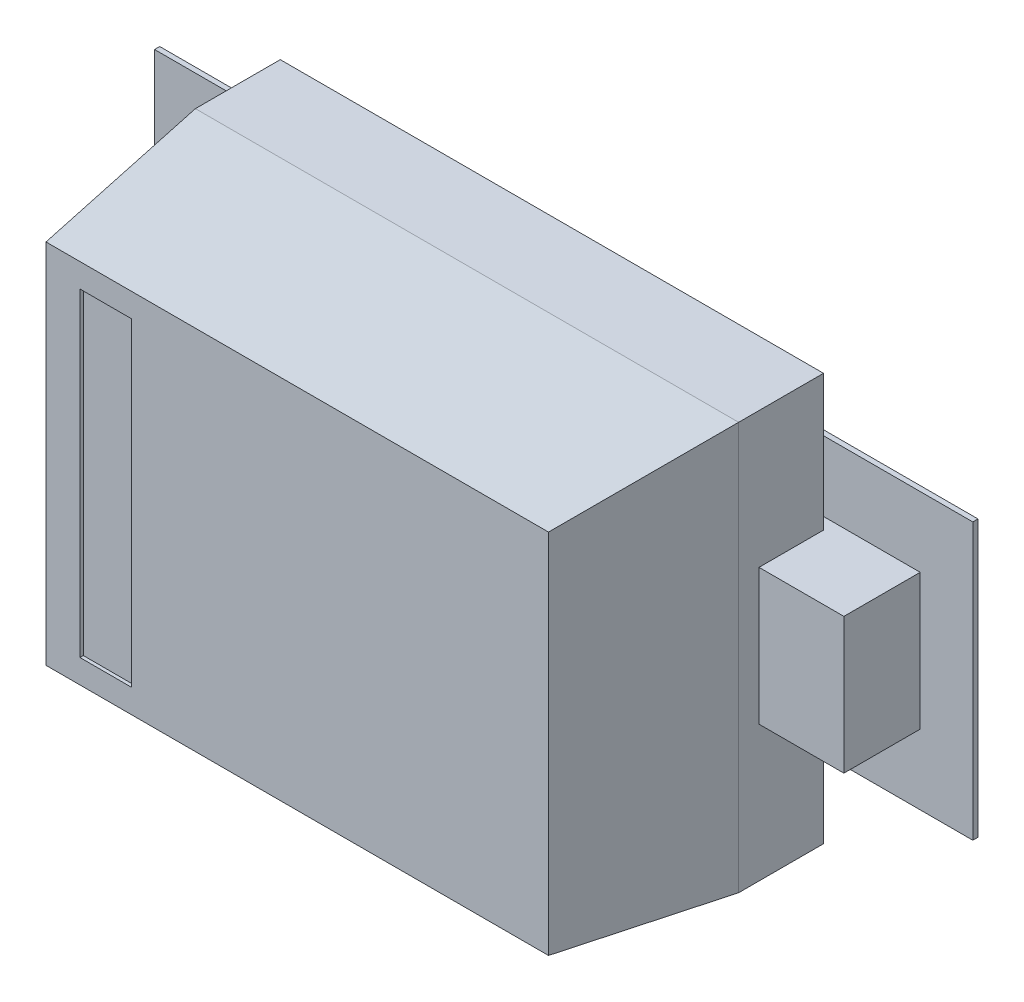
ISO-10303-21;
HEADER;
FILE_DESCRIPTION(('STEP AP214'),'2;1');
FILE_NAME('part.step','',(''),(''),'','','');
FILE_SCHEMA(('AUTOMOTIVE_DESIGN { 1 0 10303 214 1 1 1 1 }'));
ENDSEC;
DATA;
#1=APPLICATION_CONTEXT('core data for automotive mechanical design processes');
#2=APPLICATION_PROTOCOL_DEFINITION('international standard','automotive_design',2000,#1);
#3=PRODUCT_CONTEXT('',#1,'mechanical');
#4=PRODUCT('Part','Part','',(#3));
#5=PRODUCT_RELATED_PRODUCT_CATEGORY('part','',(#4));
#6=PRODUCT_DEFINITION_FORMATION('','',#4);
#7=PRODUCT_DEFINITION_CONTEXT('part definition',#1,'design');
#8=PRODUCT_DEFINITION('design','',#6,#7);
#9=PRODUCT_DEFINITION_SHAPE('','',#8);
#10=(LENGTH_UNIT() NAMED_UNIT(*) SI_UNIT(.MILLI.,.METRE.));
#11=(NAMED_UNIT(*) PLANE_ANGLE_UNIT() SI_UNIT($,.RADIAN.));
#12=(NAMED_UNIT(*) SI_UNIT($,.STERADIAN.) SOLID_ANGLE_UNIT());
#13=UNCERTAINTY_MEASURE_WITH_UNIT(LENGTH_MEASURE(1.E-05),#10,'distance_accuracy_value','');
#14=(GEOMETRIC_REPRESENTATION_CONTEXT(3) GLOBAL_UNCERTAINTY_ASSIGNED_CONTEXT((#13)) GLOBAL_UNIT_ASSIGNED_CONTEXT((#10,
#11,#12)) REPRESENTATION_CONTEXT('',''));
#15=CARTESIAN_POINT('',(0.,0.,0.));
#16=DIRECTION('',(0.,0.,1.));
#17=DIRECTION('',(1.,0.,0.));
#18=AXIS2_PLACEMENT_3D('',#15,#16,#17);
#19=CARTESIAN_POINT('',(-0.525,-0.1,0.0762));
#20=DIRECTION('',(-1.,0.,0.));
#21=DIRECTION('',(0.,0.,1.));
#22=AXIS2_PLACEMENT_3D('',#19,#20,#21);
#23=PLANE('',#22);
#24=DIRECTION('',(0.,1.,0.));
#25=VECTOR('',#24,1.);
#26=CARTESIAN_POINT('',(-0.525,-0.1,0.08382));
#27=LINE('',#26,#25);
#28=CARTESIAN_POINT('',(-0.525,-0.1,0.08382));
#29=VERTEX_POINT('',#28);
#30=CARTESIAN_POINT('',(-0.525,0.1,0.08382));
#31=VERTEX_POINT('',#30);
#32=EDGE_CURVE('E421',#29,#31,#27,.T.);
#33=ORIENTED_EDGE('',*,*,#32,.F.);
#34=DIRECTION('',(0.,0.,1.));
#35=VECTOR('',#34,1.);
#36=CARTESIAN_POINT('',(-0.525,-0.1,0.08382));
#37=LINE('',#36,#35);
#38=CARTESIAN_POINT('',(-0.525,-0.1,0.1962));
#39=VERTEX_POINT('',#38);
#40=EDGE_CURVE('E417',#29,#39,#37,.T.);
#41=ORIENTED_EDGE('',*,*,#40,.T.);
#42=DIRECTION('',(0.,1.,0.));
#43=VECTOR('',#42,1.);
#44=CARTESIAN_POINT('',(-0.525,-0.1,0.1962));
#45=LINE('',#44,#43);
#46=CARTESIAN_POINT('',(-0.525,0.1,0.1962));
#47=VERTEX_POINT('',#46);
#48=EDGE_CURVE('E11',#39,#47,#45,.T.);
#49=ORIENTED_EDGE('',*,*,#48,.T.);
#50=DIRECTION('',(0.,0.,1.));
#51=VECTOR('',#50,1.);
#52=CARTESIAN_POINT('',(-0.525,0.1,0.08382));
#53=LINE('',#52,#51);
#54=EDGE_CURVE('E457',#31,#47,#53,.T.);
#55=ORIENTED_EDGE('',*,*,#54,.F.);
#56=EDGE_LOOP('',(#33,#41,#49,#55));
#57=FACE_BOUND('',#56,.T.);
#58=ADVANCED_FACE('F16',(#57),#23,.T.);
#59=CARTESIAN_POINT('',(-0.525,-0.1,0.1962));
#60=DIRECTION('',(0.,0.,1.));
#61=DIRECTION('',(1.,0.,0.));
#62=AXIS2_PLACEMENT_3D('',#59,#60,#61);
#63=PLANE('',#62);
#64=DIRECTION('',(1.,0.,0.));
#65=VECTOR('',#64,1.);
#66=CARTESIAN_POINT('',(-0.525,-0.1,0.1962));
#67=LINE('',#66,#65);
#68=CARTESIAN_POINT('',(-0.4,-0.1,0.1962));
#69=VERTEX_POINT('',#68);
#70=EDGE_CURVE('E414',#39,#69,#67,.T.);
#71=ORIENTED_EDGE('',*,*,#70,.T.);
#72=DIRECTION('',(0.,1.,0.));
#73=VECTOR('',#72,1.);
#74=CARTESIAN_POINT('',(-0.4,-0.1,0.1962));
#75=LINE('',#74,#73);
#76=CARTESIAN_POINT('',(-0.4,0.1,0.1962));
#77=VERTEX_POINT('',#76);
#78=EDGE_CURVE('E400',#69,#77,#75,.T.);
#79=ORIENTED_EDGE('',*,*,#78,.T.);
#80=DIRECTION('',(1.,0.,0.));
#81=VECTOR('',#80,1.);
#82=CARTESIAN_POINT('',(-0.525,0.1,0.1962));
#83=LINE('',#82,#81);
#84=EDGE_CURVE('E408',#47,#77,#83,.T.);
#85=ORIENTED_EDGE('',*,*,#84,.F.);
#86=ORIENTED_EDGE('',*,*,#48,.F.);
#87=EDGE_LOOP('',(#71,#79,#85,#86));
#88=FACE_BOUND('',#87,.T.);
#89=ADVANCED_FACE('F695',(#88),#63,.T.);
#90=CARTESIAN_POINT('',(-0.325,-0.1,0.1962));
#91=DIRECTION('',(1.,0.,0.));
#92=DIRECTION('',(0.,1.,0.));
#93=AXIS2_PLACEMENT_3D('',#90,#91,#92);
#94=PLANE('',#93);
#95=DIRECTION('',(0.,1.,0.));
#96=VECTOR('',#95,1.);
#97=CARTESIAN_POINT('',(-0.325,-0.1,0.08382));
#98=LINE('',#97,#96);
#99=CARTESIAN_POINT('',(-0.325,-0.1,0.08382));
#100=VERTEX_POINT('',#99);
#101=CARTESIAN_POINT('',(-0.325,0.1,0.08382));
#102=VERTEX_POINT('',#101);
#103=EDGE_CURVE('E331',#100,#102,#98,.T.);
#104=ORIENTED_EDGE('',*,*,#103,.T.);
#105=DIRECTION('',(0.,0.,-1.));
#106=VECTOR('',#105,1.);
#107=CARTESIAN_POINT('',(-0.325,0.1,0.1012));
#108=LINE('',#107,#106);
#109=CARTESIAN_POINT('',(-0.325,0.1,0.1012));
#110=VERTEX_POINT('',#109);
#111=EDGE_CURVE('E26',#110,#102,#108,.T.);
#112=ORIENTED_EDGE('',*,*,#111,.F.);
#113=DIRECTION('',(0.,1.,0.));
#114=VECTOR('',#113,1.);
#115=CARTESIAN_POINT('',(-0.325,-0.1,0.1012));
#116=LINE('',#115,#114);
#117=CARTESIAN_POINT('',(-0.325,-0.1,0.1012));
#118=VERTEX_POINT('',#117);
#119=EDGE_CURVE('E429',#118,#110,#116,.T.);
#120=ORIENTED_EDGE('',*,*,#119,.F.);
#121=DIRECTION('',(0.,0.,-1.));
#122=VECTOR('',#121,1.);
#123=CARTESIAN_POINT('',(-0.325,-0.1,0.1012));
#124=LINE('',#123,#122);
#125=EDGE_CURVE('E312',#118,#100,#124,.T.);
#126=ORIENTED_EDGE('',*,*,#125,.T.);
#127=EDGE_LOOP('',(#104,#112,#120,#126));
#128=FACE_BOUND('',#127,.T.);
#129=ADVANCED_FACE('F699',(#128),#94,.T.);
#130=CARTESIAN_POINT('',(0.325,-0.1,0.0762));
#131=DIRECTION('',(-1.,0.,0.));
#132=DIRECTION('',(0.,0.,1.));
#133=AXIS2_PLACEMENT_3D('',#130,#131,#132);
#134=PLANE('',#133);
#135=DIRECTION('',(0.,1.,0.));
#136=VECTOR('',#135,1.);
#137=CARTESIAN_POINT('',(0.325,-0.1,0.08382));
#138=LINE('',#137,#136);
#139=CARTESIAN_POINT('',(0.325,-0.1,0.08382));
#140=VERTEX_POINT('',#139);
#141=CARTESIAN_POINT('',(0.325,0.1,0.08382));
#142=VERTEX_POINT('',#141);
#143=EDGE_CURVE('E370',#140,#142,#138,.T.);
#144=ORIENTED_EDGE('',*,*,#143,.F.);
#145=DIRECTION('',(0.,0.,1.));
#146=VECTOR('',#145,1.);
#147=CARTESIAN_POINT('',(0.325,-0.1,0.08382));
#148=LINE('',#147,#146);
#149=CARTESIAN_POINT('',(0.325,-0.1,0.1012));
#150=VERTEX_POINT('',#149);
#151=EDGE_CURVE('E313',#140,#150,#148,.T.);
#152=ORIENTED_EDGE('',*,*,#151,.T.);
#153=DIRECTION('',(0.,1.,0.));
#154=VECTOR('',#153,1.);
#155=CARTESIAN_POINT('',(0.325,-0.1,0.1012));
#156=LINE('',#155,#154);
#157=CARTESIAN_POINT('',(0.325,0.1,0.1012));
#158=VERTEX_POINT('',#157);
#159=EDGE_CURVE('E291',#150,#158,#156,.T.);
#160=ORIENTED_EDGE('',*,*,#159,.T.);
#161=DIRECTION('',(0.,0.,1.));
#162=VECTOR('',#161,1.);
#163=CARTESIAN_POINT('',(0.325,0.1,0.08382));
#164=LINE('',#163,#162);
#165=EDGE_CURVE('E286',#142,#158,#164,.T.);
#166=ORIENTED_EDGE('',*,*,#165,.F.);
#167=EDGE_LOOP('',(#144,#152,#160,#166));
#168=FACE_BOUND('',#167,.T.);
#169=ADVANCED_FACE('F731',(#168),#134,.T.);
#170=CARTESIAN_POINT('',(0.,0.1,0.));
#171=DIRECTION('',(0.,1.,0.));
#172=DIRECTION('',(1.,0.,0.));
#173=AXIS2_PLACEMENT_3D('',#170,#171,#172);
#174=PLANE('',#173);
#175=DIRECTION('',(-1.,0.,0.));
#176=VECTOR('',#175,1.);
#177=CARTESIAN_POINT('',(-0.325,0.1,0.08382));
#178=LINE('',#177,#176);
#179=EDGE_CURVE('E476',#102,#31,#178,.T.);
#180=ORIENTED_EDGE('',*,*,#179,.T.);
#181=ORIENTED_EDGE('',*,*,#54,.T.);
#182=ORIENTED_EDGE('',*,*,#84,.T.);
#183=DIRECTION('',(0.,0.,1.));
#184=VECTOR('',#183,1.);
#185=CARTESIAN_POINT('',(-0.4,0.1,0.1012));
#186=LINE('',#185,#184);
#187=CARTESIAN_POINT('',(-0.4,0.1,0.1012));
#188=VERTEX_POINT('',#187);
#189=EDGE_CURVE('E396',#188,#77,#186,.T.);
#190=ORIENTED_EDGE('',*,*,#189,.F.);
#191=DIRECTION('',(1.,0.,0.));
#192=VECTOR('',#191,1.);
#193=CARTESIAN_POINT('',(-0.4,0.1,0.1012));
#194=LINE('',#193,#192);
#195=EDGE_CURVE('E303',#188,#110,#194,.T.);
#196=ORIENTED_EDGE('',*,*,#195,.T.);
#197=ORIENTED_EDGE('',*,*,#111,.T.);
#198=EDGE_LOOP('',(#180,#181,#182,#190,#196,#197));
#199=FACE_BOUND('',#198,.T.);
#200=ADVANCED_FACE('F729',(#199),#174,.T.);
#201=CARTESIAN_POINT('',(0.,0.1,0.));
#202=DIRECTION('',(0.,1.,0.));
#203=DIRECTION('',(1.,0.,0.));
#204=AXIS2_PLACEMENT_3D('',#201,#202,#203);
#205=PLANE('',#204);
#206=DIRECTION('',(-1.,0.,0.));
#207=VECTOR('',#206,1.);
#208=CARTESIAN_POINT('',(0.525,0.1,0.08382));
#209=LINE('',#208,#207);
#210=CARTESIAN_POINT('',(0.525,0.1,0.08382));
#211=VERTEX_POINT('',#210);
#212=EDGE_CURVE('E374',#211,#142,#209,.T.);
#213=ORIENTED_EDGE('',*,*,#212,.T.);
#214=ORIENTED_EDGE('',*,*,#165,.T.);
#215=DIRECTION('',(1.,0.,0.));
#216=VECTOR('',#215,1.);
#217=CARTESIAN_POINT('',(0.325,0.1,0.1012));
#218=LINE('',#217,#216);
#219=CARTESIAN_POINT('',(0.4,0.1,0.1012));
#220=VERTEX_POINT('',#219);
#221=EDGE_CURVE('E283',#158,#220,#218,.T.);
#222=ORIENTED_EDGE('',*,*,#221,.T.);
#223=DIRECTION('',(0.,0.,-1.));
#224=VECTOR('',#223,1.);
#225=CARTESIAN_POINT('',(0.4,0.1,0.1962));
#226=LINE('',#225,#224);
#227=CARTESIAN_POINT('',(0.4,0.1,0.1962));
#228=VERTEX_POINT('',#227);
#229=EDGE_CURVE('E265',#228,#220,#226,.T.);
#230=ORIENTED_EDGE('',*,*,#229,.F.);
#231=DIRECTION('',(1.,0.,0.));
#232=VECTOR('',#231,1.);
#233=CARTESIAN_POINT('',(0.4,0.1,0.1962));
#234=LINE('',#233,#232);
#235=CARTESIAN_POINT('',(0.525,0.1,0.1962));
#236=VERTEX_POINT('',#235);
#237=EDGE_CURVE('E462',#228,#236,#234,.T.);
#238=ORIENTED_EDGE('',*,*,#237,.T.);
#239=DIRECTION('',(0.,0.,-1.));
#240=VECTOR('',#239,1.);
#241=CARTESIAN_POINT('',(0.525,0.1,0.1962));
#242=LINE('',#241,#240);
#243=EDGE_CURVE('E453',#236,#211,#242,.T.);
#244=ORIENTED_EDGE('',*,*,#243,.T.);
#245=EDGE_LOOP('',(#213,#214,#222,#230,#238,#244));
#246=FACE_BOUND('',#245,.T.);
#247=ADVANCED_FACE('F285',(#246),#205,.T.);
#248=CARTESIAN_POINT('',(0.,0.3,0.));
#249=DIRECTION('',(0.,1.,0.));
#250=DIRECTION('',(1.,0.,0.));
#251=AXIS2_PLACEMENT_3D('',#248,#249,#250);
#252=PLANE('',#251);
#253=DIRECTION('',(1.,0.,0.));
#254=VECTOR('',#253,1.);
#255=CARTESIAN_POINT('',(-0.4,0.3,0.2262));
#256=LINE('',#255,#254);
#257=CARTESIAN_POINT('',(-0.4,0.3,0.2262));
#258=VERTEX_POINT('',#257);
#259=CARTESIAN_POINT('',(0.4,0.3,0.2262));
#260=VERTEX_POINT('',#259);
#261=EDGE_CURVE('E19',#258,#260,#256,.T.);
#262=ORIENTED_EDGE('',*,*,#261,.T.);
#263=DIRECTION('',(0.,0.,-1.));
#264=VECTOR('',#263,1.);
#265=CARTESIAN_POINT('',(0.4,0.3,0.2262));
#266=LINE('',#265,#264);
#267=CARTESIAN_POINT('',(0.4,0.3,0.1012));
#268=VERTEX_POINT('',#267);
#269=EDGE_CURVE('E279',#260,#268,#266,.T.);
#270=ORIENTED_EDGE('',*,*,#269,.T.);
#271=DIRECTION('',(-1.,0.,0.));
#272=VECTOR('',#271,1.);
#273=CARTESIAN_POINT('',(0.4,0.3,0.1012));
#274=LINE('',#273,#272);
#275=CARTESIAN_POINT('',(-0.4,0.3,0.1012));
#276=VERTEX_POINT('',#275);
#277=EDGE_CURVE('E296',#268,#276,#274,.T.);
#278=ORIENTED_EDGE('',*,*,#277,.T.);
#279=DIRECTION('',(0.,0.,1.));
#280=VECTOR('',#279,1.);
#281=CARTESIAN_POINT('',(-0.4,0.3,0.1012));
#282=LINE('',#281,#280);
#283=EDGE_CURVE('E424',#276,#258,#282,.T.);
#284=ORIENTED_EDGE('',*,*,#283,.T.);
#285=EDGE_LOOP('',(#262,#270,#278,#284));
#286=FACE_BOUND('',#285,.T.);
#287=ADVANCED_FACE('F736',(#286),#252,.T.);
#288=CARTESIAN_POINT('',(0.,0.285,0.3512));
#289=DIRECTION('',(0.,0.992876838486925,0.119145220618403));
#290=DIRECTION('',(1.,0.,0.));
#291=AXIS2_PLACEMENT_3D('',#288,#289,#290);
#292=PLANE('',#291);
#293=ORIENTED_EDGE('',*,*,#261,.F.);
#294=DIRECTION('',(-0.118308451008796,0.118308451008796,-0.985903758406366));
#295=VECTOR('',#294,1.);
#296=CARTESIAN_POINT('',(-0.37,0.27,0.4762));
#297=LINE('',#296,#295);
#298=CARTESIAN_POINT('',(-0.37,0.27,0.4762));
#299=VERTEX_POINT('',#298);
#300=EDGE_CURVE('E349',#299,#258,#297,.T.);
#301=ORIENTED_EDGE('',*,*,#300,.F.);
#302=DIRECTION('',(1.,0.,0.));
#303=VECTOR('',#302,1.);
#304=CARTESIAN_POINT('',(-0.37,0.27,0.4762));
#305=LINE('',#304,#303);
#306=CARTESIAN_POINT('',(0.37,0.27,0.4762));
#307=VERTEX_POINT('',#306);
#308=EDGE_CURVE('E412',#299,#307,#305,.T.);
#309=ORIENTED_EDGE('',*,*,#308,.T.);
#310=DIRECTION('',(0.118308451008796,0.118308451008796,-0.985903758406366));
#311=VECTOR('',#310,1.);
#312=CARTESIAN_POINT('',(0.37,0.27,0.4762));
#313=LINE('',#312,#311);
#314=EDGE_CURVE('E339',#307,#260,#313,.T.);
#315=ORIENTED_EDGE('',*,*,#314,.T.);
#316=EDGE_LOOP('',(#293,#301,#309,#315));
#317=FACE_BOUND('',#316,.T.);
#318=ADVANCED_FACE('F612',(#317),#292,.T.);
#319=CARTESIAN_POINT('',(0.385,0.,0.3512));
#320=DIRECTION('',(0.992876838486925,0.,0.119145220618403));
#321=DIRECTION('',(0.,-1.,0.));
#322=AXIS2_PLACEMENT_3D('',#319,#320,#321);
#323=PLANE('',#322);
#324=DIRECTION('',(0.,-1.,0.));
#325=VECTOR('',#324,1.);
#326=CARTESIAN_POINT('',(0.4,0.3,0.2262));
#327=LINE('',#326,#325);
#328=CARTESIAN_POINT('',(0.4,-0.3,0.2262));
#329=VERTEX_POINT('',#328);
#330=EDGE_CURVE('E280',#260,#329,#327,.T.);
#331=ORIENTED_EDGE('',*,*,#330,.F.);
#332=ORIENTED_EDGE('',*,*,#314,.F.);
#333=DIRECTION('',(0.,-1.,0.));
#334=VECTOR('',#333,1.);
#335=CARTESIAN_POINT('',(0.37,0.27,0.4762));
#336=LINE('',#335,#334);
#337=CARTESIAN_POINT('',(0.37,-0.27,0.4762));
#338=VERTEX_POINT('',#337);
#339=EDGE_CURVE('E409',#307,#338,#336,.T.);
#340=ORIENTED_EDGE('',*,*,#339,.T.);
#341=DIRECTION('',(0.118308451008796,-0.118308451008796,-0.985903758406366));
#342=VECTOR('',#341,1.);
#343=CARTESIAN_POINT('',(0.37,-0.27,0.4762));
#344=LINE('',#343,#342);
#345=EDGE_CURVE('E413',#338,#329,#344,.T.);
#346=ORIENTED_EDGE('',*,*,#345,.T.);
#347=EDGE_LOOP('',(#331,#332,#340,#346));
#348=FACE_BOUND('',#347,.T.);
#349=ADVANCED_FACE('F575',(#348),#323,.T.);
#350=CARTESIAN_POINT('',(0.4,-0.3,0.4762));
#351=DIRECTION('',(1.,0.,0.));
#352=DIRECTION('',(0.,1.,0.));
#353=AXIS2_PLACEMENT_3D('',#350,#351,#352);
#354=PLANE('',#353);
#355=ORIENTED_EDGE('',*,*,#330,.T.);
#356=DIRECTION('',(0.,0.,-1.));
#357=VECTOR('',#356,1.);
#358=CARTESIAN_POINT('',(0.4,-0.3,0.2262));
#359=LINE('',#358,#357);
#360=CARTESIAN_POINT('',(0.4,-0.3,0.1012));
#361=VERTEX_POINT('',#360);
#362=EDGE_CURVE('E366',#329,#361,#359,.T.);
#363=ORIENTED_EDGE('',*,*,#362,.T.);
#364=DIRECTION('',(0.,1.,0.));
#365=VECTOR('',#364,1.);
#366=CARTESIAN_POINT('',(0.4,-0.3,0.1012));
#367=LINE('',#366,#365);
#368=CARTESIAN_POINT('',(0.4,-0.1,0.1012));
#369=VERTEX_POINT('',#368);
#370=EDGE_CURVE('E319',#361,#369,#367,.T.);
#371=ORIENTED_EDGE('',*,*,#370,.T.);
#372=DIRECTION('',(0.,0.,-1.));
#373=VECTOR('',#372,1.);
#374=CARTESIAN_POINT('',(0.4,-0.1,0.1962));
#375=LINE('',#374,#373);
#376=CARTESIAN_POINT('',(0.4,-0.1,0.1962));
#377=VERTEX_POINT('',#376);
#378=EDGE_CURVE('E505',#377,#369,#375,.T.);
#379=ORIENTED_EDGE('',*,*,#378,.F.);
#380=DIRECTION('',(0.,1.,0.));
#381=VECTOR('',#380,1.);
#382=CARTESIAN_POINT('',(0.4,-0.1,0.1962));
#383=LINE('',#382,#381);
#384=EDGE_CURVE('E274',#377,#228,#383,.T.);
#385=ORIENTED_EDGE('',*,*,#384,.T.);
#386=ORIENTED_EDGE('',*,*,#229,.T.);
#387=DIRECTION('',(0.,1.,0.));
#388=VECTOR('',#387,1.);
#389=CARTESIAN_POINT('',(0.4,0.1,0.1012));
#390=LINE('',#389,#388);
#391=EDGE_CURVE('E271',#220,#268,#390,.T.);
#392=ORIENTED_EDGE('',*,*,#391,.T.);
#393=ORIENTED_EDGE('',*,*,#269,.F.);
#394=EDGE_LOOP('',(#355,#363,#371,#379,#385,#386,#392,#393));
#395=FACE_BOUND('',#394,.T.);
#396=ADVANCED_FACE('F268',(#395),#354,.T.);
#397=CARTESIAN_POINT('',(0.325,-0.1,0.1962));
#398=DIRECTION('',(0.,0.,1.));
#399=DIRECTION('',(1.,0.,0.));
#400=AXIS2_PLACEMENT_3D('',#397,#398,#399);
#401=PLANE('',#400);
#402=DIRECTION('',(1.,0.,0.));
#403=VECTOR('',#402,1.);
#404=CARTESIAN_POINT('',(0.4,-0.1,0.1962));
#405=LINE('',#404,#403);
#406=CARTESIAN_POINT('',(0.525,-0.1,0.1962));
#407=VERTEX_POINT('',#406);
#408=EDGE_CURVE('E483',#377,#407,#405,.T.);
#409=ORIENTED_EDGE('',*,*,#408,.T.);
#410=DIRECTION('',(0.,1.,0.));
#411=VECTOR('',#410,1.);
#412=CARTESIAN_POINT('',(0.525,-0.1,0.1962));
#413=LINE('',#412,#411);
#414=EDGE_CURVE('E458',#407,#236,#413,.T.);
#415=ORIENTED_EDGE('',*,*,#414,.T.);
#416=ORIENTED_EDGE('',*,*,#237,.F.);
#417=ORIENTED_EDGE('',*,*,#384,.F.);
#418=EDGE_LOOP('',(#409,#415,#416,#417));
#419=FACE_BOUND('',#418,.T.);
#420=ADVANCED_FACE('F681',(#419),#401,.T.);
#421=CARTESIAN_POINT('',(0.525,-0.1,0.1962));
#422=DIRECTION('',(1.,0.,0.));
#423=DIRECTION('',(0.,1.,0.));
#424=AXIS2_PLACEMENT_3D('',#421,#422,#423);
#425=PLANE('',#424);
#426=DIRECTION('',(0.,1.,0.));
#427=VECTOR('',#426,1.);
#428=CARTESIAN_POINT('',(0.525,-0.1,0.08382));
#429=LINE('',#428,#427);
#430=CARTESIAN_POINT('',(0.525,-0.1,0.08382));
#431=VERTEX_POINT('',#430);
#432=EDGE_CURVE('E437',#431,#211,#429,.T.);
#433=ORIENTED_EDGE('',*,*,#432,.T.);
#434=ORIENTED_EDGE('',*,*,#243,.F.);
#435=ORIENTED_EDGE('',*,*,#414,.F.);
#436=DIRECTION('',(0.,0.,-1.));
#437=VECTOR('',#436,1.);
#438=CARTESIAN_POINT('',(0.525,-0.1,0.1962));
#439=LINE('',#438,#437);
#440=EDGE_CURVE('E318',#407,#431,#439,.T.);
#441=ORIENTED_EDGE('',*,*,#440,.T.);
#442=EDGE_LOOP('',(#433,#434,#435,#441));
#443=FACE_BOUND('',#442,.T.);
#444=ADVANCED_FACE('F672',(#443),#425,.T.);
#445=CARTESIAN_POINT('',(-0.2975102,-0.2029968,0.0762));
#446=DIRECTION('',(1.,0.,0.));
#447=DIRECTION('',(0.,1.,0.));
#448=AXIS2_PLACEMENT_3D('',#445,#446,#447);
#449=PLANE('',#448);
#450=DIRECTION('',(0.,1.,0.));
#451=VECTOR('',#450,1.);
#452=CARTESIAN_POINT('',(-0.2975102,-0.2029968,0.0762));
#453=LINE('',#452,#451);
#454=CARTESIAN_POINT('',(-0.2975102,-0.2029968,0.0762));
#455=VERTEX_POINT('',#454);
#456=CARTESIAN_POINT('',(-0.2975102,0.2029968,0.0762));
#457=VERTEX_POINT('',#456);
#458=EDGE_CURVE('E404',#455,#457,#453,.T.);
#459=ORIENTED_EDGE('',*,*,#458,.T.);
#460=DIRECTION('',(0.,0.,1.));
#461=VECTOR('',#460,1.);
#462=CARTESIAN_POINT('',(-0.2975102,0.2029968,0.0762));
#463=LINE('',#462,#461);
#464=CARTESIAN_POINT('',(-0.2975102,0.2029968,0.08382));
#465=VERTEX_POINT('',#464);
#466=EDGE_CURVE('E211',#457,#465,#463,.T.);
#467=ORIENTED_EDGE('',*,*,#466,.T.);
#468=DIRECTION('',(0.,1.,0.));
#469=VECTOR('',#468,1.);
#470=CARTESIAN_POINT('',(-0.2975102,-0.2029968,0.08382));
#471=LINE('',#470,#469);
#472=CARTESIAN_POINT('',(-0.2975102,-0.2029968,0.08382));
#473=VERTEX_POINT('',#472);
#474=EDGE_CURVE('E418',#473,#465,#471,.T.);
#475=ORIENTED_EDGE('',*,*,#474,.F.);
#476=DIRECTION('',(0.,0.,1.));
#477=VECTOR('',#476,1.);
#478=CARTESIAN_POINT('',(-0.2975102,-0.2029968,0.0762));
#479=LINE('',#478,#477);
#480=EDGE_CURVE('E369',#455,#473,#479,.T.);
#481=ORIENTED_EDGE('',*,*,#480,.F.);
#482=EDGE_LOOP('',(#459,#467,#475,#481));
#483=FACE_BOUND('',#482,.T.);
#484=ADVANCED_FACE('F689',(#483),#449,.T.);
#485=CARTESIAN_POINT('',(-0.602488,-0.2029968,0.0762));
#486=DIRECTION('',(0.,-1.,0.));
#487=DIRECTION('',(0.,0.,-1.));
#488=AXIS2_PLACEMENT_3D('',#485,#486,#487);
#489=PLANE('',#488);
#490=DIRECTION('',(1.,0.,0.));
#491=VECTOR('',#490,1.);
#492=CARTESIAN_POINT('',(-0.602488,-0.2029968,0.0762));
#493=LINE('',#492,#491);
#494=CARTESIAN_POINT('',(-0.602488,-0.2029968,0.0762));
#495=VERTEX_POINT('',#494);
#496=EDGE_CURVE('E525',#495,#455,#493,.T.);
#497=ORIENTED_EDGE('',*,*,#496,.T.);
#498=ORIENTED_EDGE('',*,*,#480,.T.);
#499=DIRECTION('',(1.,0.,0.));
#500=VECTOR('',#499,1.);
#501=CARTESIAN_POINT('',(-0.602488,-0.2029968,0.08382));
#502=LINE('',#501,#500);
#503=CARTESIAN_POINT('',(-0.602488,-0.2029968,0.08382));
#504=VERTEX_POINT('',#503);
#505=EDGE_CURVE('E386',#504,#473,#502,.T.);
#506=ORIENTED_EDGE('',*,*,#505,.F.);
#507=DIRECTION('',(0.,0.,1.));
#508=VECTOR('',#507,1.);
#509=CARTESIAN_POINT('',(-0.602488,-0.2029968,0.0762));
#510=LINE('',#509,#508);
#511=EDGE_CURVE('E335',#495,#504,#510,.T.);
#512=ORIENTED_EDGE('',*,*,#511,.F.);
#513=EDGE_LOOP('',(#497,#498,#506,#512));
#514=FACE_BOUND('',#513,.T.);
#515=ADVANCED_FACE('F755',(#514),#489,.T.);
#516=CARTESIAN_POINT('',(-0.602488,0.2029968,0.0762));
#517=DIRECTION('',(-1.,0.,0.));
#518=DIRECTION('',(0.,0.,1.));
#519=AXIS2_PLACEMENT_3D('',#516,#517,#518);
#520=PLANE('',#519);
#521=DIRECTION('',(0.,-1.,0.));
#522=VECTOR('',#521,1.);
#523=CARTESIAN_POINT('',(-0.602488,0.2029968,0.0762));
#524=LINE('',#523,#522);
#525=CARTESIAN_POINT('',(-0.602488,0.2029968,0.0762));
#526=VERTEX_POINT('',#525);
#527=EDGE_CURVE('E449',#526,#495,#524,.T.);
#528=ORIENTED_EDGE('',*,*,#527,.T.);
#529=ORIENTED_EDGE('',*,*,#511,.T.);
#530=DIRECTION('',(0.,-1.,0.));
#531=VECTOR('',#530,1.);
#532=CARTESIAN_POINT('',(-0.602488,0.2029968,0.08382));
#533=LINE('',#532,#531);
#534=CARTESIAN_POINT('',(-0.602488,0.2029968,0.08382));
#535=VERTEX_POINT('',#534);
#536=EDGE_CURVE('E382',#535,#504,#533,.T.);
#537=ORIENTED_EDGE('',*,*,#536,.F.);
#538=DIRECTION('',(0.,0.,1.));
#539=VECTOR('',#538,1.);
#540=CARTESIAN_POINT('',(-0.602488,0.2029968,0.0762));
#541=LINE('',#540,#539);
#542=EDGE_CURVE('E354',#526,#535,#541,.T.);
#543=ORIENTED_EDGE('',*,*,#542,.F.);
#544=EDGE_LOOP('',(#528,#529,#537,#543));
#545=FACE_BOUND('',#544,.T.);
#546=ADVANCED_FACE('F751',(#545),#520,.T.);
#547=CARTESIAN_POINT('',(0.2975102,0.2029968,0.0762));
#548=DIRECTION('',(-1.,0.,0.));
#549=DIRECTION('',(0.,0.,1.));
#550=AXIS2_PLACEMENT_3D('',#547,#548,#549);
#551=PLANE('',#550);
#552=DIRECTION('',(0.,-1.,0.));
#553=VECTOR('',#552,1.);
#554=CARTESIAN_POINT('',(0.2975102,0.2029968,0.0762));
#555=LINE('',#554,#553);
#556=CARTESIAN_POINT('',(0.2975102,0.2029968,0.0762));
#557=VERTEX_POINT('',#556);
#558=CARTESIAN_POINT('',(0.2975102,-0.2029968,0.0762));
#559=VERTEX_POINT('',#558);
#560=EDGE_CURVE('E380',#557,#559,#555,.T.);
#561=ORIENTED_EDGE('',*,*,#560,.T.);
#562=DIRECTION('',(0.,0.,1.));
#563=VECTOR('',#562,1.);
#564=CARTESIAN_POINT('',(0.2975102,-0.2029968,0.0762));
#565=LINE('',#564,#563);
#566=CARTESIAN_POINT('',(0.2975102,-0.2029968,0.08382));
#567=VERTEX_POINT('',#566);
#568=EDGE_CURVE('E332',#559,#567,#565,.T.);
#569=ORIENTED_EDGE('',*,*,#568,.T.);
#570=DIRECTION('',(0.,-1.,0.));
#571=VECTOR('',#570,1.);
#572=CARTESIAN_POINT('',(0.2975102,0.2029968,0.08382));
#573=LINE('',#572,#571);
#574=CARTESIAN_POINT('',(0.2975102,0.2029968,0.08382));
#575=VERTEX_POINT('',#574);
#576=EDGE_CURVE('E330',#575,#567,#573,.T.);
#577=ORIENTED_EDGE('',*,*,#576,.F.);
#578=DIRECTION('',(0.,0.,1.));
#579=VECTOR('',#578,1.);
#580=CARTESIAN_POINT('',(0.2975102,0.2029968,0.0762));
#581=LINE('',#580,#579);
#582=EDGE_CURVE('E104',#557,#575,#581,.T.);
#583=ORIENTED_EDGE('',*,*,#582,.F.);
#584=EDGE_LOOP('',(#561,#569,#577,#583));
#585=FACE_BOUND('',#584,.T.);
#586=ADVANCED_FACE('F754',(#585),#551,.T.);
#587=CARTESIAN_POINT('',(0.2975102,-0.2029968,0.0762));
#588=DIRECTION('',(0.,-1.,0.));
#589=DIRECTION('',(0.,0.,-1.));
#590=AXIS2_PLACEMENT_3D('',#587,#588,#589);
#591=PLANE('',#590);
#592=DIRECTION('',(1.,0.,0.));
#593=VECTOR('',#592,1.);
#594=CARTESIAN_POINT('',(0.2975102,-0.2029968,0.0762));
#595=LINE('',#594,#593);
#596=CARTESIAN_POINT('',(0.602488,-0.2029968,0.0762));
#597=VERTEX_POINT('',#596);
#598=EDGE_CURVE('E376',#559,#597,#595,.T.);
#599=ORIENTED_EDGE('',*,*,#598,.T.);
#600=DIRECTION('',(0.,0.,1.));
#601=VECTOR('',#600,1.);
#602=CARTESIAN_POINT('',(0.602488,-0.2029968,0.0762));
#603=LINE('',#602,#601);
#604=CARTESIAN_POINT('',(0.602488,-0.2029968,0.08382));
#605=VERTEX_POINT('',#604);
#606=EDGE_CURVE('E336',#597,#605,#603,.T.);
#607=ORIENTED_EDGE('',*,*,#606,.T.);
#608=DIRECTION('',(1.,0.,0.));
#609=VECTOR('',#608,1.);
#610=CARTESIAN_POINT('',(0.2975102,-0.2029968,0.08382));
#611=LINE('',#610,#609);
#612=EDGE_CURVE('E425',#567,#605,#611,.T.);
#613=ORIENTED_EDGE('',*,*,#612,.F.);
#614=ORIENTED_EDGE('',*,*,#568,.F.);
#615=EDGE_LOOP('',(#599,#607,#613,#614));
#616=FACE_BOUND('',#615,.T.);
#617=ADVANCED_FACE('F760',(#616),#591,.T.);
#618=CARTESIAN_POINT('',(0.602488,-0.2029968,0.0762));
#619=DIRECTION('',(1.,0.,0.));
#620=DIRECTION('',(0.,1.,0.));
#621=AXIS2_PLACEMENT_3D('',#618,#619,#620);
#622=PLANE('',#621);
#623=DIRECTION('',(0.,1.,0.));
#624=VECTOR('',#623,1.);
#625=CARTESIAN_POINT('',(0.602488,-0.2029968,0.0762));
#626=LINE('',#625,#624);
#627=CARTESIAN_POINT('',(0.602488,0.2029968,0.0762));
#628=VERTEX_POINT('',#627);
#629=EDGE_CURVE('E381',#597,#628,#626,.T.);
#630=ORIENTED_EDGE('',*,*,#629,.T.);
#631=DIRECTION('',(0.,0.,1.));
#632=VECTOR('',#631,1.);
#633=CARTESIAN_POINT('',(0.602488,0.2029968,0.0762));
#634=LINE('',#633,#632);
#635=CARTESIAN_POINT('',(0.602488,0.2029968,0.08382));
#636=VERTEX_POINT('',#635);
#637=EDGE_CURVE('E120',#628,#636,#634,.T.);
#638=ORIENTED_EDGE('',*,*,#637,.T.);
#639=DIRECTION('',(0.,1.,0.));
#640=VECTOR('',#639,1.);
#641=CARTESIAN_POINT('',(0.602488,-0.2029968,0.08382));
#642=LINE('',#641,#640);
#643=EDGE_CURVE('E375',#605,#636,#642,.T.);
#644=ORIENTED_EDGE('',*,*,#643,.F.);
#645=ORIENTED_EDGE('',*,*,#606,.F.);
#646=EDGE_LOOP('',(#630,#638,#644,#645));
#647=FACE_BOUND('',#646,.T.);
#648=ADVANCED_FACE('F762',(#647),#622,.T.);
#649=CARTESIAN_POINT('',(0.602488,0.2029968,0.0762));
#650=DIRECTION('',(0.,1.,0.));
#651=DIRECTION('',(1.,0.,0.));
#652=AXIS2_PLACEMENT_3D('',#649,#650,#651);
#653=PLANE('',#652);
#654=DIRECTION('',(-1.,0.,0.));
#655=VECTOR('',#654,1.);
#656=CARTESIAN_POINT('',(0.602488,0.2029968,0.0762));
#657=LINE('',#656,#655);
#658=EDGE_CURVE('E353',#628,#557,#657,.T.);
#659=ORIENTED_EDGE('',*,*,#658,.T.);
#660=ORIENTED_EDGE('',*,*,#582,.T.);
#661=DIRECTION('',(-1.,0.,0.));
#662=VECTOR('',#661,1.);
#663=CARTESIAN_POINT('',(0.602488,0.2029968,0.08382));
#664=LINE('',#663,#662);
#665=EDGE_CURVE('E326',#636,#575,#664,.T.);
#666=ORIENTED_EDGE('',*,*,#665,.F.);
#667=ORIENTED_EDGE('',*,*,#637,.F.);
#668=EDGE_LOOP('',(#659,#660,#666,#667));
#669=FACE_BOUND('',#668,.T.);
#670=ADVANCED_FACE('F773',(#669),#653,.T.);
#671=CARTESIAN_POINT('',(-0.325,-0.1,0.0762));
#672=DIRECTION('',(0.,0.,-1.));
#673=DIRECTION('',(0.,-1.,0.));
#674=AXIS2_PLACEMENT_3D('',#671,#672,#673);
#675=PLANE('',#674);
#676=DIRECTION('',(-1.,0.,0.));
#677=VECTOR('',#676,1.);
#678=CARTESIAN_POINT('',(-0.2975102,0.2029968,0.0762));
#679=LINE('',#678,#677);
#680=EDGE_CURVE('E529',#457,#526,#679,.T.);
#681=ORIENTED_EDGE('',*,*,#680,.F.);
#682=ORIENTED_EDGE('',*,*,#458,.F.);
#683=ORIENTED_EDGE('',*,*,#496,.F.);
#684=ORIENTED_EDGE('',*,*,#527,.F.);
#685=EDGE_LOOP('',(#681,#682,#683,#684));
#686=FACE_BOUND('',#685,.T.);
#687=ADVANCED_FACE('F776',(#686),#675,.T.);
#688=CARTESIAN_POINT('',(-0.325,-0.1,0.0762));
#689=DIRECTION('',(0.,0.,-1.));
#690=DIRECTION('',(0.,-1.,0.));
#691=AXIS2_PLACEMENT_3D('',#688,#689,#690);
#692=PLANE('',#691);
#693=ORIENTED_EDGE('',*,*,#658,.F.);
#694=ORIENTED_EDGE('',*,*,#629,.F.);
#695=ORIENTED_EDGE('',*,*,#598,.F.);
#696=ORIENTED_EDGE('',*,*,#560,.F.);
#697=EDGE_LOOP('',(#693,#694,#695,#696));
#698=FACE_BOUND('',#697,.T.);
#699=ADVANCED_FACE('F783',(#698),#692,.T.);
#700=CARTESIAN_POINT('',(-0.2975102,0.2029968,0.0762));
#701=DIRECTION('',(0.,1.,0.));
#702=DIRECTION('',(1.,0.,0.));
#703=AXIS2_PLACEMENT_3D('',#700,#701,#702);
#704=PLANE('',#703);
#705=ORIENTED_EDGE('',*,*,#680,.T.);
#706=ORIENTED_EDGE('',*,*,#542,.T.);
#707=DIRECTION('',(-1.,0.,0.));
#708=VECTOR('',#707,1.);
#709=CARTESIAN_POINT('',(-0.2975102,0.2029968,0.08382));
#710=LINE('',#709,#708);
#711=EDGE_CURVE('E387',#465,#535,#710,.T.);
#712=ORIENTED_EDGE('',*,*,#711,.F.);
#713=ORIENTED_EDGE('',*,*,#466,.F.);
#714=EDGE_LOOP('',(#705,#706,#712,#713));
#715=FACE_BOUND('',#714,.T.);
#716=ADVANCED_FACE('F818',(#715),#704,.T.);
#717=CARTESIAN_POINT('',(0.,0.,0.08382));
#718=DIRECTION('',(0.,0.,1.));
#719=DIRECTION('',(1.,0.,0.));
#720=AXIS2_PLACEMENT_3D('',#717,#718,#719);
#721=PLANE('',#720);
#722=DIRECTION('',(-1.,0.,0.));
#723=VECTOR('',#722,1.);
#724=CARTESIAN_POINT('',(0.525,-0.1,0.08382));
#725=LINE('',#724,#723);
#726=EDGE_CURVE('E314',#431,#140,#725,.T.);
#727=ORIENTED_EDGE('',*,*,#726,.T.);
#728=ORIENTED_EDGE('',*,*,#143,.T.);
#729=ORIENTED_EDGE('',*,*,#212,.F.);
#730=ORIENTED_EDGE('',*,*,#432,.F.);
#731=EDGE_LOOP('',(#727,#728,#729,#730));
#732=FACE_BOUND('',#731,.T.);
#733=ORIENTED_EDGE('',*,*,#665,.T.);
#734=ORIENTED_EDGE('',*,*,#576,.T.);
#735=ORIENTED_EDGE('',*,*,#612,.T.);
#736=ORIENTED_EDGE('',*,*,#643,.T.);
#737=EDGE_LOOP('',(#733,#734,#735,#736));
#738=FACE_BOUND('',#737,.T.);
#739=ADVANCED_FACE('F677',(#732,#738),#721,.T.);
#740=CARTESIAN_POINT('',(0.,0.,0.08382));
#741=DIRECTION('',(0.,0.,1.));
#742=DIRECTION('',(1.,0.,0.));
#743=AXIS2_PLACEMENT_3D('',#740,#741,#742);
#744=PLANE('',#743);
#745=DIRECTION('',(-1.,0.,0.));
#746=VECTOR('',#745,1.);
#747=CARTESIAN_POINT('',(-0.325,-0.1,0.08382));
#748=LINE('',#747,#746);
#749=EDGE_CURVE('E309',#100,#29,#748,.T.);
#750=ORIENTED_EDGE('',*,*,#749,.T.);
#751=ORIENTED_EDGE('',*,*,#32,.T.);
#752=ORIENTED_EDGE('',*,*,#179,.F.);
#753=ORIENTED_EDGE('',*,*,#103,.F.);
#754=EDGE_LOOP('',(#750,#751,#752,#753));
#755=FACE_BOUND('',#754,.T.);
#756=ORIENTED_EDGE('',*,*,#711,.T.);
#757=ORIENTED_EDGE('',*,*,#536,.T.);
#758=ORIENTED_EDGE('',*,*,#505,.T.);
#759=ORIENTED_EDGE('',*,*,#474,.T.);
#760=EDGE_LOOP('',(#756,#757,#758,#759));
#761=FACE_BOUND('',#760,.T.);
#762=ADVANCED_FACE('F709',(#755,#761),#744,.T.);
#763=CARTESIAN_POINT('',(0.,-0.1,0.));
#764=DIRECTION('',(0.,1.,0.));
#765=DIRECTION('',(1.,0.,0.));
#766=AXIS2_PLACEMENT_3D('',#763,#764,#765);
#767=PLANE('',#766);
#768=ORIENTED_EDGE('',*,*,#749,.F.);
#769=ORIENTED_EDGE('',*,*,#125,.F.);
#770=DIRECTION('',(1.,0.,0.));
#771=VECTOR('',#770,1.);
#772=CARTESIAN_POINT('',(-0.4,-0.1,0.1012));
#773=LINE('',#772,#771);
#774=CARTESIAN_POINT('',(-0.4,-0.1,0.1012));
#775=VERTEX_POINT('',#774);
#776=EDGE_CURVE('E359',#775,#118,#773,.T.);
#777=ORIENTED_EDGE('',*,*,#776,.F.);
#778=DIRECTION('',(0.,0.,1.));
#779=VECTOR('',#778,1.);
#780=CARTESIAN_POINT('',(-0.4,-0.1,0.1012));
#781=LINE('',#780,#779);
#782=EDGE_CURVE('E360',#775,#69,#781,.T.);
#783=ORIENTED_EDGE('',*,*,#782,.T.);
#784=ORIENTED_EDGE('',*,*,#70,.F.);
#785=ORIENTED_EDGE('',*,*,#40,.F.);
#786=EDGE_LOOP('',(#768,#769,#777,#783,#784,#785));
#787=FACE_BOUND('',#786,.T.);
#788=ADVANCED_FACE('F707',(#787),#767,.F.);
#789=CARTESIAN_POINT('',(0.,-0.1,0.));
#790=DIRECTION('',(0.,1.,0.));
#791=DIRECTION('',(1.,0.,0.));
#792=AXIS2_PLACEMENT_3D('',#789,#790,#791);
#793=PLANE('',#792);
#794=ORIENTED_EDGE('',*,*,#726,.F.);
#795=ORIENTED_EDGE('',*,*,#440,.F.);
#796=ORIENTED_EDGE('',*,*,#408,.F.);
#797=ORIENTED_EDGE('',*,*,#378,.T.);
#798=DIRECTION('',(1.,0.,0.));
#799=VECTOR('',#798,1.);
#800=CARTESIAN_POINT('',(0.325,-0.1,0.1012));
#801=LINE('',#800,#799);
#802=EDGE_CURVE('E542',#150,#369,#801,.T.);
#803=ORIENTED_EDGE('',*,*,#802,.F.);
#804=ORIENTED_EDGE('',*,*,#151,.F.);
#805=EDGE_LOOP('',(#794,#795,#796,#797,#803,#804));
#806=FACE_BOUND('',#805,.T.);
#807=ADVANCED_FACE('F759',(#806),#793,.F.);
#808=CARTESIAN_POINT('',(-0.41,-0.3302,0.1012));
#809=DIRECTION('',(0.,0.,1.));
#810=DIRECTION('',(1.,0.,0.));
#811=AXIS2_PLACEMENT_3D('',#808,#809,#810);
#812=PLANE('',#811);
#813=ORIENTED_EDGE('',*,*,#776,.T.);
#814=ORIENTED_EDGE('',*,*,#119,.T.);
#815=ORIENTED_EDGE('',*,*,#195,.F.);
#816=DIRECTION('',(0.,1.,0.));
#817=VECTOR('',#816,1.);
#818=CARTESIAN_POINT('',(-0.4,0.1,0.1012));
#819=LINE('',#818,#817);
#820=EDGE_CURVE('E401',#188,#276,#819,.T.);
#821=ORIENTED_EDGE('',*,*,#820,.T.);
#822=ORIENTED_EDGE('',*,*,#277,.F.);
#823=ORIENTED_EDGE('',*,*,#391,.F.);
#824=ORIENTED_EDGE('',*,*,#221,.F.);
#825=ORIENTED_EDGE('',*,*,#159,.F.);
#826=ORIENTED_EDGE('',*,*,#802,.T.);
#827=ORIENTED_EDGE('',*,*,#370,.F.);
#828=DIRECTION('',(-1.,0.,0.));
#829=VECTOR('',#828,1.);
#830=CARTESIAN_POINT('',(0.4,-0.3,0.1012));
#831=LINE('',#830,#829);
#832=CARTESIAN_POINT('',(-0.4,-0.3,0.1012));
#833=VERTEX_POINT('',#832);
#834=EDGE_CURVE('E466',#361,#833,#831,.T.);
#835=ORIENTED_EDGE('',*,*,#834,.T.);
#836=DIRECTION('',(0.,1.,0.));
#837=VECTOR('',#836,1.);
#838=CARTESIAN_POINT('',(-0.4,-0.3,0.1012));
#839=LINE('',#838,#837);
#840=EDGE_CURVE('E355',#833,#775,#839,.T.);
#841=ORIENTED_EDGE('',*,*,#840,.T.);
#842=EDGE_LOOP('',(#813,#814,#815,#821,#822,#823,#824,#825,#826,#827,#835,#841));
#843=FACE_BOUND('',#842,.T.);
#844=ADVANCED_FACE('F294',(#843),#812,.F.);
#845=CARTESIAN_POINT('',(-0.4,-0.3,0.0762));
#846=DIRECTION('',(-1.,0.,0.));
#847=DIRECTION('',(0.,0.,1.));
#848=AXIS2_PLACEMENT_3D('',#845,#846,#847);
#849=PLANE('',#848);
#850=DIRECTION('',(0.,0.,1.));
#851=VECTOR('',#850,1.);
#852=CARTESIAN_POINT('',(-0.4,-0.3,0.1012));
#853=LINE('',#852,#851);
#854=CARTESIAN_POINT('',(-0.4,-0.3,0.2262));
#855=VERTEX_POINT('',#854);
#856=EDGE_CURVE('E392',#833,#855,#853,.T.);
#857=ORIENTED_EDGE('',*,*,#856,.T.);
#858=DIRECTION('',(0.,-1.,0.));
#859=VECTOR('',#858,1.);
#860=CARTESIAN_POINT('',(-0.4,0.3,0.2262));
#861=LINE('',#860,#859);
#862=EDGE_CURVE('E307',#258,#855,#861,.T.);
#863=ORIENTED_EDGE('',*,*,#862,.F.);
#864=ORIENTED_EDGE('',*,*,#283,.F.);
#865=ORIENTED_EDGE('',*,*,#820,.F.);
#866=ORIENTED_EDGE('',*,*,#189,.T.);
#867=ORIENTED_EDGE('',*,*,#78,.F.);
#868=ORIENTED_EDGE('',*,*,#782,.F.);
#869=ORIENTED_EDGE('',*,*,#840,.F.);
#870=EDGE_LOOP('',(#857,#863,#864,#865,#866,#867,#868,#869));
#871=FACE_BOUND('',#870,.T.);
#872=ADVANCED_FACE('F593',(#871),#849,.T.);
#873=CARTESIAN_POINT('',(-0.385,0.,0.3512));
#874=DIRECTION('',(-0.992876838486925,0.,0.119145220618403));
#875=DIRECTION('',(0.,1.,0.));
#876=AXIS2_PLACEMENT_3D('',#873,#874,#875);
#877=PLANE('',#876);
#878=DIRECTION('',(0.118308451008796,0.118308451008796,0.985903758406366));
#879=VECTOR('',#878,1.);
#880=CARTESIAN_POINT('',(-0.4,-0.3,0.2262));
#881=LINE('',#880,#879);
#882=CARTESIAN_POINT('',(-0.37,-0.27,0.4762));
#883=VERTEX_POINT('',#882);
#884=EDGE_CURVE('E365',#855,#883,#881,.T.);
#885=ORIENTED_EDGE('',*,*,#884,.T.);
#886=DIRECTION('',(0.,-1.,0.));
#887=VECTOR('',#886,1.);
#888=CARTESIAN_POINT('',(-0.37,0.27,0.4762));
#889=LINE('',#888,#887);
#890=EDGE_CURVE('E344',#299,#883,#889,.T.);
#891=ORIENTED_EDGE('',*,*,#890,.F.);
#892=ORIENTED_EDGE('',*,*,#300,.T.);
#893=ORIENTED_EDGE('',*,*,#862,.T.);
#894=EDGE_LOOP('',(#885,#891,#892,#893));
#895=FACE_BOUND('',#894,.T.);
#896=ADVANCED_FACE('F608',(#895),#877,.T.);
#897=CARTESIAN_POINT('',(0.,-0.3,0.4712));
#898=DIRECTION('',(0.,0.,1.));
#899=DIRECTION('',(1.,0.,0.));
#900=AXIS2_PLACEMENT_3D('',#897,#898,#899);
#901=PLANE('',#900);
#902=DIRECTION('',(0.,1.,0.));
#903=VECTOR('',#902,1.);
#904=CARTESIAN_POINT('',(-0.2438,-0.235,0.4712));
#905=LINE('',#904,#903);
#906=CARTESIAN_POINT('',(-0.2438,-0.235,0.4712));
#907=VERTEX_POINT('',#906);
#908=CARTESIAN_POINT('',(-0.2438,0.235,0.4712));
#909=VERTEX_POINT('',#908);
#910=EDGE_CURVE('E324',#907,#909,#905,.T.);
#911=ORIENTED_EDGE('',*,*,#910,.T.);
#912=DIRECTION('',(-1.,0.,0.));
#913=VECTOR('',#912,1.);
#914=CARTESIAN_POINT('',(-0.2438,0.235,0.4712));
#915=LINE('',#914,#913);
#916=CARTESIAN_POINT('',(-0.32,0.235,0.4712));
#917=VERTEX_POINT('',#916);
#918=EDGE_CURVE('E346',#909,#917,#915,.T.);
#919=ORIENTED_EDGE('',*,*,#918,.T.);
#920=DIRECTION('',(0.,-1.,0.));
#921=VECTOR('',#920,1.);
#922=CARTESIAN_POINT('',(-0.32,0.235,0.4712));
#923=LINE('',#922,#921);
#924=CARTESIAN_POINT('',(-0.32,-0.235,0.4712));
#925=VERTEX_POINT('',#924);
#926=EDGE_CURVE('E499',#917,#925,#923,.T.);
#927=ORIENTED_EDGE('',*,*,#926,.T.);
#928=DIRECTION('',(1.,0.,0.));
#929=VECTOR('',#928,1.);
#930=CARTESIAN_POINT('',(-0.32,-0.235,0.4712));
#931=LINE('',#930,#929);
#932=EDGE_CURVE('E492',#925,#907,#931,.T.);
#933=ORIENTED_EDGE('',*,*,#932,.T.);
#934=EDGE_LOOP('',(#911,#919,#927,#933));
#935=FACE_BOUND('',#934,.T.);
#936=ADVANCED_FACE('F785',(#935),#901,.T.);
#937=CARTESIAN_POINT('',(-0.2438,0.235,0.4762));
#938=DIRECTION('',(0.,1.,0.));
#939=DIRECTION('',(1.,0.,0.));
#940=AXIS2_PLACEMENT_3D('',#937,#938,#939);
#941=PLANE('',#940);
#942=DIRECTION('',(-1.,0.,0.));
#943=VECTOR('',#942,1.);
#944=CARTESIAN_POINT('',(-0.2438,0.235,0.4762));
#945=LINE('',#944,#943);
#946=CARTESIAN_POINT('',(-0.2438,0.235,0.4762));
#947=VERTEX_POINT('',#946);
#948=CARTESIAN_POINT('',(-0.32,0.235,0.4762));
#949=VERTEX_POINT('',#948);
#950=EDGE_CURVE('E325',#947,#949,#945,.T.);
#951=ORIENTED_EDGE('',*,*,#950,.T.);
#952=DIRECTION('',(0.,0.,-1.));
#953=VECTOR('',#952,1.);
#954=CARTESIAN_POINT('',(-0.32,0.235,0.4762));
#955=LINE('',#954,#953);
#956=EDGE_CURVE('E350',#949,#917,#955,.T.);
#957=ORIENTED_EDGE('',*,*,#956,.T.);
#958=ORIENTED_EDGE('',*,*,#918,.F.);
#959=DIRECTION('',(0.,0.,-1.));
#960=VECTOR('',#959,1.);
#961=CARTESIAN_POINT('',(-0.2438,0.235,0.4762));
#962=LINE('',#961,#960);
#963=EDGE_CURVE('E320',#947,#909,#962,.T.);
#964=ORIENTED_EDGE('',*,*,#963,.F.);
#965=EDGE_LOOP('',(#951,#957,#958,#964));
#966=FACE_BOUND('',#965,.T.);
#967=ADVANCED_FACE('F788',(#966),#941,.F.);
#968=CARTESIAN_POINT('',(-0.32,0.235,0.4762));
#969=DIRECTION('',(-1.,0.,0.));
#970=DIRECTION('',(0.,0.,1.));
#971=AXIS2_PLACEMENT_3D('',#968,#969,#970);
#972=PLANE('',#971);
#973=DIRECTION('',(0.,-1.,0.));
#974=VECTOR('',#973,1.);
#975=CARTESIAN_POINT('',(-0.32,0.235,0.4762));
#976=LINE('',#975,#974);
#977=CARTESIAN_POINT('',(-0.32,-0.235,0.4762));
#978=VERTEX_POINT('',#977);
#979=EDGE_CURVE('E502',#949,#978,#976,.T.);
#980=ORIENTED_EDGE('',*,*,#979,.T.);
#981=DIRECTION('',(0.,0.,-1.));
#982=VECTOR('',#981,1.);
#983=CARTESIAN_POINT('',(-0.32,-0.235,0.4762));
#984=LINE('',#983,#982);
#985=EDGE_CURVE('E495',#978,#925,#984,.T.);
#986=ORIENTED_EDGE('',*,*,#985,.T.);
#987=ORIENTED_EDGE('',*,*,#926,.F.);
#988=ORIENTED_EDGE('',*,*,#956,.F.);
#989=EDGE_LOOP('',(#980,#986,#987,#988));
#990=FACE_BOUND('',#989,.T.);
#991=ADVANCED_FACE('F801',(#990),#972,.F.);
#992=CARTESIAN_POINT('',(-0.32,-0.235,0.4762));
#993=DIRECTION('',(0.,-1.,0.));
#994=DIRECTION('',(0.,0.,-1.));
#995=AXIS2_PLACEMENT_3D('',#992,#993,#994);
#996=PLANE('',#995);
#997=DIRECTION('',(1.,0.,0.));
#998=VECTOR('',#997,1.);
#999=CARTESIAN_POINT('',(-0.32,-0.235,0.4762));
#1000=LINE('',#999,#998);
#1001=CARTESIAN_POINT('',(-0.2438,-0.235,0.4762));
#1002=VERTEX_POINT('',#1001);
#1003=EDGE_CURVE('E343',#978,#1002,#1000,.T.);
#1004=ORIENTED_EDGE('',*,*,#1003,.T.);
#1005=DIRECTION('',(0.,0.,-1.));
#1006=VECTOR('',#1005,1.);
#1007=CARTESIAN_POINT('',(-0.2438,-0.235,0.4762));
#1008=LINE('',#1007,#1006);
#1009=EDGE_CURVE('E473',#1002,#907,#1008,.T.);
#1010=ORIENTED_EDGE('',*,*,#1009,.T.);
#1011=ORIENTED_EDGE('',*,*,#932,.F.);
#1012=ORIENTED_EDGE('',*,*,#985,.F.);
#1013=EDGE_LOOP('',(#1004,#1010,#1011,#1012));
#1014=FACE_BOUND('',#1013,.T.);
#1015=ADVANCED_FACE('F745',(#1014),#996,.F.);
#1016=CARTESIAN_POINT('',(-0.2438,-0.235,0.4762));
#1017=DIRECTION('',(1.,0.,0.));
#1018=DIRECTION('',(0.,1.,0.));
#1019=AXIS2_PLACEMENT_3D('',#1016,#1017,#1018);
#1020=PLANE('',#1019);
#1021=DIRECTION('',(0.,1.,0.));
#1022=VECTOR('',#1021,1.);
#1023=CARTESIAN_POINT('',(-0.2438,-0.235,0.4762));
#1024=LINE('',#1023,#1022);
#1025=EDGE_CURVE('E340',#1002,#947,#1024,.T.);
#1026=ORIENTED_EDGE('',*,*,#1025,.T.);
#1027=ORIENTED_EDGE('',*,*,#963,.T.);
#1028=ORIENTED_EDGE('',*,*,#910,.F.);
#1029=ORIENTED_EDGE('',*,*,#1009,.F.);
#1030=EDGE_LOOP('',(#1026,#1027,#1028,#1029));
#1031=FACE_BOUND('',#1030,.T.);
#1032=ADVANCED_FACE('F741',(#1031),#1020,.F.);
#1033=CARTESIAN_POINT('',(-0.4,-0.3,0.4762));
#1034=DIRECTION('',(0.,0.,1.));
#1035=DIRECTION('',(1.,0.,0.));
#1036=AXIS2_PLACEMENT_3D('',#1033,#1034,#1035);
#1037=PLANE('',#1036);
#1038=ORIENTED_EDGE('',*,*,#1025,.F.);
#1039=ORIENTED_EDGE('',*,*,#1003,.F.);
#1040=ORIENTED_EDGE('',*,*,#979,.F.);
#1041=ORIENTED_EDGE('',*,*,#950,.F.);
#1042=EDGE_LOOP('',(#1038,#1039,#1040,#1041));
#1043=FACE_BOUND('',#1042,.T.);
#1044=DIRECTION('',(-1.,0.,0.));
#1045=VECTOR('',#1044,1.);
#1046=CARTESIAN_POINT('',(0.37,-0.27,0.4762));
#1047=LINE('',#1046,#1045);
#1048=EDGE_CURVE('E361',#338,#883,#1047,.T.);
#1049=ORIENTED_EDGE('',*,*,#1048,.F.);
#1050=ORIENTED_EDGE('',*,*,#339,.F.);
#1051=ORIENTED_EDGE('',*,*,#308,.F.);
#1052=ORIENTED_EDGE('',*,*,#890,.T.);
#1053=EDGE_LOOP('',(#1049,#1050,#1051,#1052));
#1054=FACE_BOUND('',#1053,.T.);
#1055=ADVANCED_FACE('F744',(#1043,#1054),#1037,.T.);
#1056=CARTESIAN_POINT('',(0.,-0.285,0.3512));
#1057=DIRECTION('',(0.,-0.992876838486925,0.119145220618403));
#1058=DIRECTION('',(-1.,0.,0.));
#1059=AXIS2_PLACEMENT_3D('',#1056,#1057,#1058);
#1060=PLANE('',#1059);
#1061=ORIENTED_EDGE('',*,*,#1048,.T.);
#1062=ORIENTED_EDGE('',*,*,#884,.F.);
#1063=DIRECTION('',(-1.,0.,0.));
#1064=VECTOR('',#1063,1.);
#1065=CARTESIAN_POINT('',(0.4,-0.3,0.2262));
#1066=LINE('',#1065,#1064);
#1067=EDGE_CURVE('E388',#329,#855,#1066,.T.);
#1068=ORIENTED_EDGE('',*,*,#1067,.F.);
#1069=ORIENTED_EDGE('',*,*,#345,.F.);
#1070=EDGE_LOOP('',(#1061,#1062,#1068,#1069));
#1071=FACE_BOUND('',#1070,.T.);
#1072=ADVANCED_FACE('F587',(#1071),#1060,.T.);
#1073=CARTESIAN_POINT('',(0.,-0.3,0.));
#1074=DIRECTION('',(0.,1.,0.));
#1075=DIRECTION('',(1.,0.,0.));
#1076=AXIS2_PLACEMENT_3D('',#1073,#1074,#1075);
#1077=PLANE('',#1076);
#1078=ORIENTED_EDGE('',*,*,#1067,.T.);
#1079=ORIENTED_EDGE('',*,*,#856,.F.);
#1080=ORIENTED_EDGE('',*,*,#834,.F.);
#1081=ORIENTED_EDGE('',*,*,#362,.F.);
#1082=EDGE_LOOP('',(#1078,#1079,#1080,#1081));
#1083=FACE_BOUND('',#1082,.T.);
#1084=ADVANCED_FACE('F584',(#1083),#1077,.F.);
#1085=CLOSED_SHELL('',(#58,#89,#129,#169,#200,#247,#287,#318,#349,#396,#420,#444,#484,#515,#546,
#586,#617,#648,#670,#687,#699,#716,#739,#762,#788,#807,#844,#872,#896,#936,#967,#991,#1015,
#1032,#1055,#1072,#1084));
#1086=MANIFOLD_SOLID_BREP('B1',#1085);
#1087=ADVANCED_BREP_SHAPE_REPRESENTATION('',(#18,#1086),#14);
#1088=SHAPE_DEFINITION_REPRESENTATION(#9,#1087);
ENDSEC;
END-ISO-10303-21;
